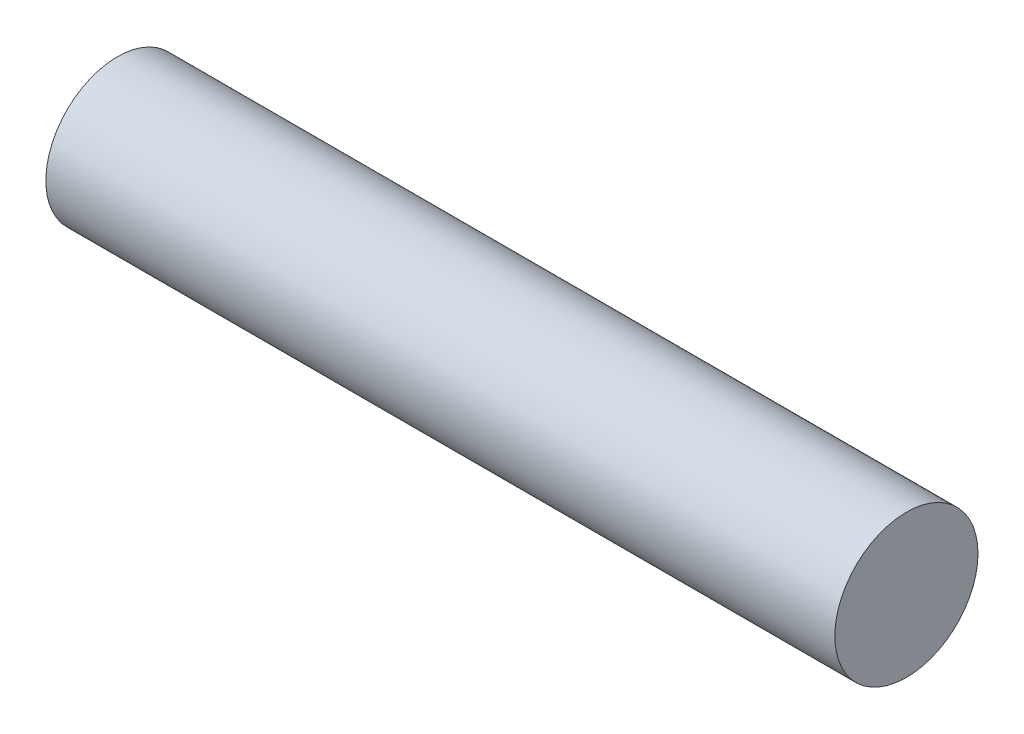
ISO-10303-21;
HEADER;
FILE_DESCRIPTION(('STEP AP214'),'2;1');
FILE_NAME('part.step','',(''),(''),'','','');
FILE_SCHEMA(('AUTOMOTIVE_DESIGN { 1 0 10303 214 1 1 1 1 }'));
ENDSEC;
DATA;
#1=APPLICATION_CONTEXT('core data for automotive mechanical design processes');
#2=APPLICATION_PROTOCOL_DEFINITION('international standard','automotive_design',2000,#1);
#3=PRODUCT_CONTEXT('',#1,'mechanical');
#4=PRODUCT('Part','Part','',(#3));
#5=PRODUCT_RELATED_PRODUCT_CATEGORY('part','',(#4));
#6=PRODUCT_DEFINITION_FORMATION('','',#4);
#7=PRODUCT_DEFINITION_CONTEXT('part definition',#1,'design');
#8=PRODUCT_DEFINITION('design','',#6,#7);
#9=PRODUCT_DEFINITION_SHAPE('','',#8);
#10=(LENGTH_UNIT() NAMED_UNIT(*) SI_UNIT(.MILLI.,.METRE.));
#11=(NAMED_UNIT(*) PLANE_ANGLE_UNIT() SI_UNIT($,.RADIAN.));
#12=(NAMED_UNIT(*) SI_UNIT($,.STERADIAN.) SOLID_ANGLE_UNIT());
#13=UNCERTAINTY_MEASURE_WITH_UNIT(LENGTH_MEASURE(1.E-05),#10,'distance_accuracy_value','');
#14=(GEOMETRIC_REPRESENTATION_CONTEXT(3) GLOBAL_UNCERTAINTY_ASSIGNED_CONTEXT((#13)) GLOBAL_UNIT_ASSIGNED_CONTEXT((#10,
#11,#12)) REPRESENTATION_CONTEXT('',''));
#15=CARTESIAN_POINT('',(0.,0.,0.));
#16=DIRECTION('',(0.,0.,1.));
#17=DIRECTION('',(1.,0.,0.));
#18=AXIS2_PLACEMENT_3D('',#15,#16,#17);
#19=CARTESIAN_POINT('',(27.,0.,0.));
#20=DIRECTION('',(-1.,0.,0.));
#21=DIRECTION('',(0.,0.,1.));
#22=AXIS2_PLACEMENT_3D('',#19,#20,#21);
#23=CYLINDRICAL_SURFACE('',#22,4.9);
#24=CARTESIAN_POINT('',(27.,0.,0.));
#25=DIRECTION('',(1.,0.,0.));
#26=DIRECTION('',(0.,0.,-1.));
#27=AXIS2_PLACEMENT_3D('',#24,#25,#26);
#28=CIRCLE('',#27,4.9);
#29=CARTESIAN_POINT('',(27.,0.,-4.9));
#30=VERTEX_POINT('',#29);
#31=EDGE_CURVE('E10',#30,#30,#28,.T.);
#32=ORIENTED_EDGE('',*,*,#31,.F.);
#33=EDGE_LOOP('',(#32));
#34=FACE_BOUND('',#33,.T.);
#35=CARTESIAN_POINT('',(-27.,0.,0.));
#36=DIRECTION('',(1.,0.,0.));
#37=DIRECTION('',(0.,0.,-1.));
#38=AXIS2_PLACEMENT_3D('',#35,#36,#37);
#39=CIRCLE('',#38,4.9);
#40=CARTESIAN_POINT('',(-27.,0.,-4.9));
#41=VERTEX_POINT('',#40);
#42=EDGE_CURVE('E36',#41,#41,#39,.T.);
#43=ORIENTED_EDGE('',*,*,#42,.T.);
#44=EDGE_LOOP('',(#43));
#45=FACE_BOUND('',#44,.T.);
#46=ADVANCED_FACE('F33',(#34,#45),#23,.T.);
#47=CARTESIAN_POINT('',(27.,0.,0.));
#48=DIRECTION('',(1.,0.,0.));
#49=DIRECTION('',(0.,0.,-1.));
#50=AXIS2_PLACEMENT_3D('',#47,#48,#49);
#51=PLANE('',#50);
#52=ORIENTED_EDGE('',*,*,#31,.T.);
#53=EDGE_LOOP('',(#52));
#54=FACE_BOUND('',#53,.T.);
#55=ADVANCED_FACE('F48',(#54),#51,.T.);
#56=CARTESIAN_POINT('',(-27.,0.,0.));
#57=DIRECTION('',(1.,0.,0.));
#58=DIRECTION('',(0.,0.,-1.));
#59=AXIS2_PLACEMENT_3D('',#56,#57,#58);
#60=PLANE('',#59);
#61=ORIENTED_EDGE('',*,*,#42,.F.);
#62=EDGE_LOOP('',(#61));
#63=FACE_BOUND('',#62,.T.);
#64=ADVANCED_FACE('F46',(#63),#60,.F.);
#65=CLOSED_SHELL('',(#46,#55,#64));
#66=MANIFOLD_SOLID_BREP('B2',#65);
#67=ADVANCED_BREP_SHAPE_REPRESENTATION('',(#18,#66),#14);
#68=SHAPE_DEFINITION_REPRESENTATION(#9,#67);
ENDSEC;
END-ISO-10303-21;
